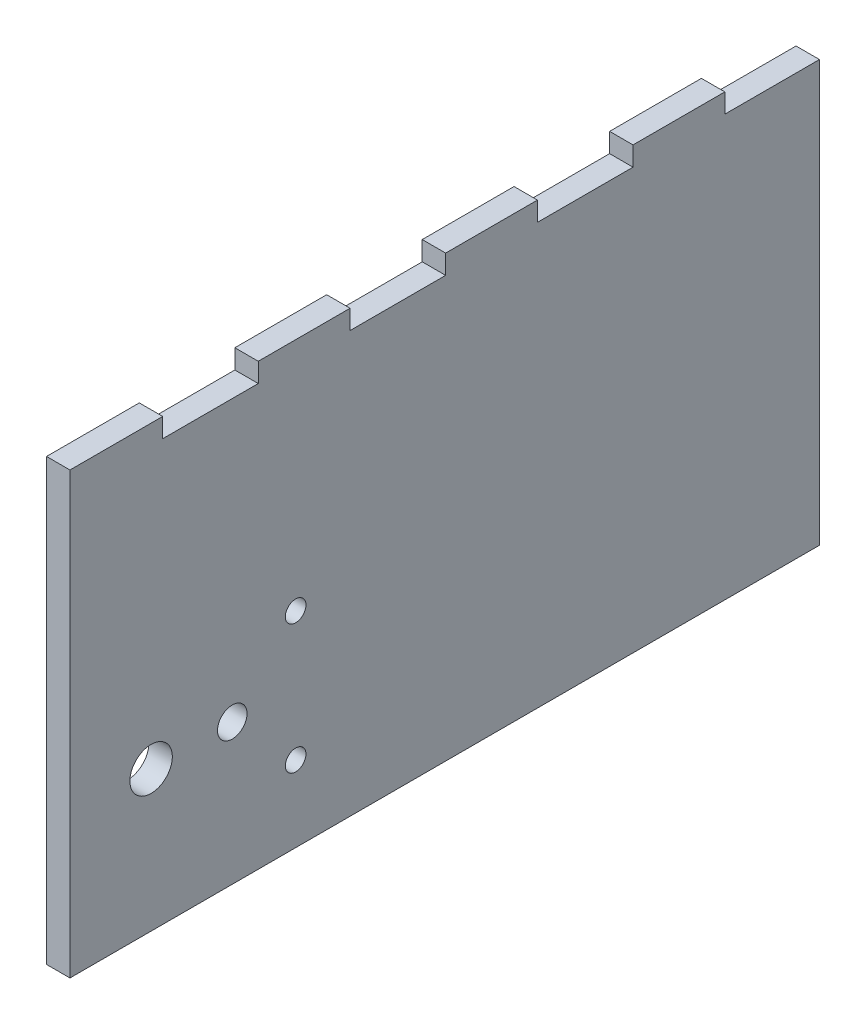
ISO-10303-21;
HEADER;
FILE_DESCRIPTION(('STEP AP214'),'2;1');
FILE_NAME('part.step','',(''),(''),'','','');
FILE_SCHEMA(('AUTOMOTIVE_DESIGN { 1 0 10303 214 1 1 1 1 }'));
ENDSEC;
DATA;
#1=APPLICATION_CONTEXT('core data for automotive mechanical design processes');
#2=APPLICATION_PROTOCOL_DEFINITION('international standard','automotive_design',2000,#1);
#3=PRODUCT_CONTEXT('',#1,'mechanical');
#4=PRODUCT('Part','Part','',(#3));
#5=PRODUCT_RELATED_PRODUCT_CATEGORY('part','',(#4));
#6=PRODUCT_DEFINITION_FORMATION('','',#4);
#7=PRODUCT_DEFINITION_CONTEXT('part definition',#1,'design');
#8=PRODUCT_DEFINITION('design','',#6,#7);
#9=PRODUCT_DEFINITION_SHAPE('','',#8);
#10=(LENGTH_UNIT() NAMED_UNIT(*) SI_UNIT(.MILLI.,.METRE.));
#11=(NAMED_UNIT(*) PLANE_ANGLE_UNIT() SI_UNIT($,.RADIAN.));
#12=(NAMED_UNIT(*) SI_UNIT($,.STERADIAN.) SOLID_ANGLE_UNIT());
#13=UNCERTAINTY_MEASURE_WITH_UNIT(LENGTH_MEASURE(1.E-05),#10,'distance_accuracy_value','');
#14=(GEOMETRIC_REPRESENTATION_CONTEXT(3) GLOBAL_UNCERTAINTY_ASSIGNED_CONTEXT((#13)) GLOBAL_UNIT_ASSIGNED_CONTEXT((#10,
#11,#12)) REPRESENTATION_CONTEXT('',''));
#15=CARTESIAN_POINT('',(0.,0.,0.));
#16=DIRECTION('',(0.,0.,1.));
#17=DIRECTION('',(1.,0.,0.));
#18=AXIS2_PLACEMENT_3D('',#15,#16,#17);
#19=CARTESIAN_POINT('',(3.175,0.,-101.6));
#20=DIRECTION('',(0.,1.,0.));
#21=DIRECTION('',(0.,0.,1.));
#22=AXIS2_PLACEMENT_3D('',#19,#20,#21);
#23=PLANE('',#22);
#24=DIRECTION('',(0.,0.,-1.));
#25=VECTOR('',#24,1.);
#26=CARTESIAN_POINT('',(0.,0.,-101.6));
#27=LINE('',#26,#25);
#28=CARTESIAN_POINT('',(0.,0.,0.));
#29=VERTEX_POINT('',#28);
#30=CARTESIAN_POINT('',(0.,0.,-101.6));
#31=VERTEX_POINT('',#30);
#32=EDGE_CURVE('E284',#29,#31,#27,.T.);
#33=ORIENTED_EDGE('',*,*,#32,.T.);
#34=DIRECTION('',(-1.,0.,0.));
#35=VECTOR('',#34,1.);
#36=CARTESIAN_POINT('',(3.175,0.,-101.6));
#37=LINE('',#36,#35);
#38=CARTESIAN_POINT('',(3.175,0.,-101.6));
#39=VERTEX_POINT('',#38);
#40=EDGE_CURVE('E11',#39,#31,#37,.T.);
#41=ORIENTED_EDGE('',*,*,#40,.F.);
#42=DIRECTION('',(0.,0.,-1.));
#43=VECTOR('',#42,1.);
#44=CARTESIAN_POINT('',(3.175,0.,-101.6));
#45=LINE('',#44,#43);
#46=CARTESIAN_POINT('',(3.175,0.,0.));
#47=VERTEX_POINT('',#46);
#48=EDGE_CURVE('E287',#47,#39,#45,.T.);
#49=ORIENTED_EDGE('',*,*,#48,.F.);
#50=DIRECTION('',(-1.,0.,0.));
#51=VECTOR('',#50,1.);
#52=CARTESIAN_POINT('',(3.175,0.,0.));
#53=LINE('',#52,#51);
#54=EDGE_CURVE('E304',#47,#29,#53,.T.);
#55=ORIENTED_EDGE('',*,*,#54,.T.);
#56=EDGE_LOOP('',(#33,#41,#49,#55));
#57=FACE_BOUND('',#56,.T.);
#58=ADVANCED_FACE('F33',(#57),#23,.F.);
#59=CARTESIAN_POINT('',(3.175,57.15,-101.6));
#60=DIRECTION('',(0.,0.,1.));
#61=DIRECTION('',(0.,-1.,0.));
#62=AXIS2_PLACEMENT_3D('',#59,#60,#61);
#63=PLANE('',#62);
#64=DIRECTION('',(0.,1.,0.));
#65=VECTOR('',#64,1.);
#66=CARTESIAN_POINT('',(0.,57.15,-101.6));
#67=LINE('',#66,#65);
#68=CARTESIAN_POINT('',(0.,57.023,-101.6));
#69=VERTEX_POINT('',#68);
#70=EDGE_CURVE('E307',#31,#69,#67,.T.);
#71=ORIENTED_EDGE('',*,*,#70,.T.);
#72=DIRECTION('',(1.,0.,0.));
#73=VECTOR('',#72,1.);
#74=CARTESIAN_POINT('',(0.,57.023,-101.6));
#75=LINE('',#74,#73);
#76=CARTESIAN_POINT('',(3.175,57.023,-101.6));
#77=VERTEX_POINT('',#76);
#78=EDGE_CURVE('E47',#69,#77,#75,.T.);
#79=ORIENTED_EDGE('',*,*,#78,.T.);
#80=DIRECTION('',(0.,1.,0.));
#81=VECTOR('',#80,1.);
#82=CARTESIAN_POINT('',(3.175,57.15,-101.6));
#83=LINE('',#82,#81);
#84=EDGE_CURVE('E290',#39,#77,#83,.T.);
#85=ORIENTED_EDGE('',*,*,#84,.F.);
#86=ORIENTED_EDGE('',*,*,#40,.T.);
#87=EDGE_LOOP('',(#71,#79,#85,#86));
#88=FACE_BOUND('',#87,.T.);
#89=ADVANCED_FACE('F384',(#88),#63,.F.);
#90=CARTESIAN_POINT('',(3.175,59.6392,-76.2));
#91=DIRECTION('',(0.,-1.,0.));
#92=DIRECTION('',(0.,0.,-1.));
#93=AXIS2_PLACEMENT_3D('',#90,#91,#92);
#94=PLANE('',#93);
#95=DIRECTION('',(0.,0.,1.));
#96=VECTOR('',#95,1.);
#97=CARTESIAN_POINT('',(3.175,59.6392,-76.2));
#98=LINE('',#97,#96);
#99=CARTESIAN_POINT('',(3.175,59.6392,-88.773));
#100=VERTEX_POINT('',#99);
#101=CARTESIAN_POINT('',(3.175,59.6392,-76.327));
#102=VERTEX_POINT('',#101);
#103=EDGE_CURVE('E294',#100,#102,#98,.T.);
#104=ORIENTED_EDGE('',*,*,#103,.F.);
#105=DIRECTION('',(1.,0.,0.));
#106=VECTOR('',#105,1.);
#107=CARTESIAN_POINT('',(0.,59.6392,-88.773));
#108=LINE('',#107,#106);
#109=CARTESIAN_POINT('',(0.,59.6392,-88.773));
#110=VERTEX_POINT('',#109);
#111=EDGE_CURVE('E180',#110,#100,#108,.T.);
#112=ORIENTED_EDGE('',*,*,#111,.F.);
#113=DIRECTION('',(0.,0.,1.));
#114=VECTOR('',#113,1.);
#115=CARTESIAN_POINT('',(0.,59.6392,-76.2));
#116=LINE('',#115,#114);
#117=CARTESIAN_POINT('',(0.,59.6392,-76.327));
#118=VERTEX_POINT('',#117);
#119=EDGE_CURVE('E55',#110,#118,#116,.T.);
#120=ORIENTED_EDGE('',*,*,#119,.T.);
#121=DIRECTION('',(1.,0.,0.));
#122=VECTOR('',#121,1.);
#123=CARTESIAN_POINT('',(0.,59.6392,-76.327));
#124=LINE('',#123,#122);
#125=EDGE_CURVE('E206',#118,#102,#124,.T.);
#126=ORIENTED_EDGE('',*,*,#125,.T.);
#127=EDGE_LOOP('',(#104,#112,#120,#126));
#128=FACE_BOUND('',#127,.T.);
#129=ADVANCED_FACE('F382',(#128),#94,.F.);
#130=CARTESIAN_POINT('',(3.175,59.6392,-50.8));
#131=DIRECTION('',(0.,-1.,0.));
#132=DIRECTION('',(0.,0.,-1.));
#133=AXIS2_PLACEMENT_3D('',#130,#131,#132);
#134=PLANE('',#133);
#135=DIRECTION('',(0.,0.,1.));
#136=VECTOR('',#135,1.);
#137=CARTESIAN_POINT('',(3.175,59.6392,-50.8));
#138=LINE('',#137,#136);
#139=CARTESIAN_POINT('',(3.175,59.6392,-63.373));
#140=VERTEX_POINT('',#139);
#141=CARTESIAN_POINT('',(3.175,59.6392,-50.927));
#142=VERTEX_POINT('',#141);
#143=EDGE_CURVE('E296',#140,#142,#138,.T.);
#144=ORIENTED_EDGE('',*,*,#143,.F.);
#145=DIRECTION('',(1.,0.,0.));
#146=VECTOR('',#145,1.);
#147=CARTESIAN_POINT('',(0.,59.6392,-63.373));
#148=LINE('',#147,#146);
#149=CARTESIAN_POINT('',(0.,59.6392,-63.373));
#150=VERTEX_POINT('',#149);
#151=EDGE_CURVE('E204',#150,#140,#148,.T.);
#152=ORIENTED_EDGE('',*,*,#151,.F.);
#153=DIRECTION('',(0.,0.,1.));
#154=VECTOR('',#153,1.);
#155=CARTESIAN_POINT('',(0.,59.6392,-50.8));
#156=LINE('',#155,#154);
#157=CARTESIAN_POINT('',(0.,59.6392,-50.927));
#158=VERTEX_POINT('',#157);
#159=EDGE_CURVE('E310',#150,#158,#156,.T.);
#160=ORIENTED_EDGE('',*,*,#159,.T.);
#161=DIRECTION('',(1.,0.,0.));
#162=VECTOR('',#161,1.);
#163=CARTESIAN_POINT('',(0.,59.6392,-50.927));
#164=LINE('',#163,#162);
#165=EDGE_CURVE('E232',#158,#142,#164,.T.);
#166=ORIENTED_EDGE('',*,*,#165,.T.);
#167=EDGE_LOOP('',(#144,#152,#160,#166));
#168=FACE_BOUND('',#167,.T.);
#169=ADVANCED_FACE('F369',(#168),#134,.F.);
#170=CARTESIAN_POINT('',(3.175,59.6392,-25.4));
#171=DIRECTION('',(0.,-1.,0.));
#172=DIRECTION('',(0.,0.,-1.));
#173=AXIS2_PLACEMENT_3D('',#170,#171,#172);
#174=PLANE('',#173);
#175=DIRECTION('',(0.,0.,1.));
#176=VECTOR('',#175,1.);
#177=CARTESIAN_POINT('',(3.175,59.6392,-25.4));
#178=LINE('',#177,#176);
#179=CARTESIAN_POINT('',(3.175,59.6392,-37.973));
#180=VERTEX_POINT('',#179);
#181=CARTESIAN_POINT('',(3.175,59.6392,-25.527));
#182=VERTEX_POINT('',#181);
#183=EDGE_CURVE('E298',#180,#182,#178,.T.);
#184=ORIENTED_EDGE('',*,*,#183,.F.);
#185=DIRECTION('',(1.,0.,0.));
#186=VECTOR('',#185,1.);
#187=CARTESIAN_POINT('',(0.,59.6392,-37.973));
#188=LINE('',#187,#186);
#189=CARTESIAN_POINT('',(0.,59.6392,-37.973));
#190=VERTEX_POINT('',#189);
#191=EDGE_CURVE('E230',#190,#180,#188,.T.);
#192=ORIENTED_EDGE('',*,*,#191,.F.);
#193=DIRECTION('',(0.,0.,1.));
#194=VECTOR('',#193,1.);
#195=CARTESIAN_POINT('',(0.,59.6392,-25.4));
#196=LINE('',#195,#194);
#197=CARTESIAN_POINT('',(0.,59.6392,-25.527));
#198=VERTEX_POINT('',#197);
#199=EDGE_CURVE('E312',#190,#198,#196,.T.);
#200=ORIENTED_EDGE('',*,*,#199,.T.);
#201=DIRECTION('',(1.,0.,0.));
#202=VECTOR('',#201,1.);
#203=CARTESIAN_POINT('',(0.,59.6392,-25.527));
#204=LINE('',#203,#202);
#205=EDGE_CURVE('E259',#198,#182,#204,.T.);
#206=ORIENTED_EDGE('',*,*,#205,.T.);
#207=EDGE_LOOP('',(#184,#192,#200,#206));
#208=FACE_BOUND('',#207,.T.);
#209=ADVANCED_FACE('F351',(#208),#174,.F.);
#210=CARTESIAN_POINT('',(3.175,59.6392,0.));
#211=DIRECTION('',(0.,-1.,0.));
#212=DIRECTION('',(0.,0.,-1.));
#213=AXIS2_PLACEMENT_3D('',#210,#211,#212);
#214=PLANE('',#213);
#215=DIRECTION('',(0.,0.,1.));
#216=VECTOR('',#215,1.);
#217=CARTESIAN_POINT('',(3.175,59.6392,0.));
#218=LINE('',#217,#216);
#219=CARTESIAN_POINT('',(3.175,59.6392,-12.573));
#220=VERTEX_POINT('',#219);
#221=CARTESIAN_POINT('',(3.175,59.6392,0.));
#222=VERTEX_POINT('',#221);
#223=EDGE_CURVE('E300',#220,#222,#218,.T.);
#224=ORIENTED_EDGE('',*,*,#223,.F.);
#225=DIRECTION('',(1.,0.,0.));
#226=VECTOR('',#225,1.);
#227=CARTESIAN_POINT('',(0.,59.6392,-12.573));
#228=LINE('',#227,#226);
#229=CARTESIAN_POINT('',(0.,59.6392,-12.573));
#230=VERTEX_POINT('',#229);
#231=EDGE_CURVE('E257',#230,#220,#228,.T.);
#232=ORIENTED_EDGE('',*,*,#231,.F.);
#233=DIRECTION('',(0.,0.,1.));
#234=VECTOR('',#233,1.);
#235=CARTESIAN_POINT('',(0.,59.6392,0.));
#236=LINE('',#235,#234);
#237=CARTESIAN_POINT('',(0.,59.6392,0.));
#238=VERTEX_POINT('',#237);
#239=EDGE_CURVE('E314',#230,#238,#236,.T.);
#240=ORIENTED_EDGE('',*,*,#239,.T.);
#241=DIRECTION('',(-1.,0.,0.));
#242=VECTOR('',#241,1.);
#243=CARTESIAN_POINT('',(3.175,59.6392,0.));
#244=LINE('',#243,#242);
#245=EDGE_CURVE('E40',#222,#238,#244,.T.);
#246=ORIENTED_EDGE('',*,*,#245,.F.);
#247=EDGE_LOOP('',(#224,#232,#240,#246));
#248=FACE_BOUND('',#247,.T.);
#249=ADVANCED_FACE('F337',(#248),#214,.F.);
#250=CARTESIAN_POINT('',(3.175,0.,0.));
#251=DIRECTION('',(0.,0.,-1.));
#252=DIRECTION('',(-1.,0.,0.));
#253=AXIS2_PLACEMENT_3D('',#250,#251,#252);
#254=PLANE('',#253);
#255=DIRECTION('',(0.,-1.,0.));
#256=VECTOR('',#255,1.);
#257=CARTESIAN_POINT('',(0.,0.,0.));
#258=LINE('',#257,#256);
#259=EDGE_CURVE('E291',#238,#29,#258,.T.);
#260=ORIENTED_EDGE('',*,*,#259,.T.);
#261=ORIENTED_EDGE('',*,*,#54,.F.);
#262=DIRECTION('',(0.,-1.,0.));
#263=VECTOR('',#262,1.);
#264=CARTESIAN_POINT('',(3.175,0.,0.));
#265=LINE('',#264,#263);
#266=EDGE_CURVE('E302',#222,#47,#265,.T.);
#267=ORIENTED_EDGE('',*,*,#266,.F.);
#268=ORIENTED_EDGE('',*,*,#245,.T.);
#269=EDGE_LOOP('',(#260,#261,#267,#268));
#270=FACE_BOUND('',#269,.T.);
#271=ADVANCED_FACE('F323',(#270),#254,.F.);
#272=CARTESIAN_POINT('',(3.175,0.,0.));
#273=DIRECTION('',(-1.,0.,0.));
#274=DIRECTION('',(0.,0.,1.));
#275=AXIS2_PLACEMENT_3D('',#272,#273,#274);
#276=PLANE('',#275);
#277=CARTESIAN_POINT('',(3.175,19.05,-11.));
#278=DIRECTION('',(1.,0.,0.));
#279=DIRECTION('',(0.,0.,1.));
#280=AXIS2_PLACEMENT_3D('',#277,#278,#279);
#281=CIRCLE('',#280,2.87699996099999);
#282=CARTESIAN_POINT('',(3.175,19.05,-8.12300003899999));
#283=VERTEX_POINT('',#282);
#284=EDGE_CURVE('E263',#283,#283,#281,.T.);
#285=ORIENTED_EDGE('',*,*,#284,.F.);
#286=EDGE_LOOP('',(#285));
#287=FACE_BOUND('',#286,.T.);
#288=CARTESIAN_POINT('',(3.175,19.05,-22.0000034));
#289=DIRECTION('',(1.,0.,0.));
#290=DIRECTION('',(0.,0.,1.));
#291=AXIS2_PLACEMENT_3D('',#288,#289,#290);
#292=CIRCLE('',#291,1.99999999999998);
#293=CARTESIAN_POINT('',(3.175,19.05,-20.0000034));
#294=VERTEX_POINT('',#293);
#295=EDGE_CURVE('E269',#294,#294,#292,.T.);
#296=ORIENTED_EDGE('',*,*,#295,.F.);
#297=EDGE_LOOP('',(#296));
#298=FACE_BOUND('',#297,.T.);
#299=CARTESIAN_POINT('',(3.175,27.8,-30.59102));
#300=DIRECTION('',(1.,0.,0.));
#301=DIRECTION('',(0.,0.,1.));
#302=AXIS2_PLACEMENT_3D('',#299,#300,#301);
#303=CIRCLE('',#302,1.39999999999999);
#304=CARTESIAN_POINT('',(3.175,27.8,-29.19102));
#305=VERTEX_POINT('',#304);
#306=EDGE_CURVE('E275',#305,#305,#303,.T.);
#307=ORIENTED_EDGE('',*,*,#306,.F.);
#308=EDGE_LOOP('',(#307));
#309=FACE_BOUND('',#308,.T.);
#310=CARTESIAN_POINT('',(3.175,10.3,-30.59102));
#311=DIRECTION('',(1.,0.,0.));
#312=DIRECTION('',(0.,0.,1.));
#313=AXIS2_PLACEMENT_3D('',#310,#311,#312);
#314=CIRCLE('',#313,1.39999999999999);
#315=CARTESIAN_POINT('',(3.175,10.3,-29.19102));
#316=VERTEX_POINT('',#315);
#317=EDGE_CURVE('E281',#316,#316,#314,.T.);
#318=ORIENTED_EDGE('',*,*,#317,.F.);
#319=EDGE_LOOP('',(#318));
#320=FACE_BOUND('',#319,.T.);
#321=DIRECTION('',(0.,0.,-1.));
#322=VECTOR('',#321,1.);
#323=CARTESIAN_POINT('',(3.175,57.0230000000001,0.));
#324=LINE('',#323,#322);
#325=CARTESIAN_POINT('',(3.175,57.023,-88.773));
#326=VERTEX_POINT('',#325);
#327=EDGE_CURVE('E175',#326,#77,#324,.T.);
#328=ORIENTED_EDGE('',*,*,#327,.F.);
#329=DIRECTION('',(0.,-1.,0.));
#330=VECTOR('',#329,1.);
#331=CARTESIAN_POINT('',(3.175,0.,-88.773));
#332=LINE('',#331,#330);
#333=EDGE_CURVE('E164',#100,#326,#332,.T.);
#334=ORIENTED_EDGE('',*,*,#333,.F.);
#335=ORIENTED_EDGE('',*,*,#103,.T.);
#336=DIRECTION('',(0.,1.,0.));
#337=VECTOR('',#336,1.);
#338=CARTESIAN_POINT('',(3.175,0.,-76.327));
#339=LINE('',#338,#337);
#340=CARTESIAN_POINT('',(3.175,57.023,-76.327));
#341=VERTEX_POINT('',#340);
#342=EDGE_CURVE('E196',#341,#102,#339,.T.);
#343=ORIENTED_EDGE('',*,*,#342,.F.);
#344=DIRECTION('',(0.,0.,-1.));
#345=VECTOR('',#344,1.);
#346=CARTESIAN_POINT('',(3.175,57.023,0.));
#347=LINE('',#346,#345);
#348=CARTESIAN_POINT('',(3.175,57.023,-63.373));
#349=VERTEX_POINT('',#348);
#350=EDGE_CURVE('E182',#349,#341,#347,.T.);
#351=ORIENTED_EDGE('',*,*,#350,.F.);
#352=DIRECTION('',(0.,-1.,0.));
#353=VECTOR('',#352,1.);
#354=CARTESIAN_POINT('',(3.175,0.,-63.373));
#355=LINE('',#354,#353);
#356=EDGE_CURVE('E188',#140,#349,#355,.T.);
#357=ORIENTED_EDGE('',*,*,#356,.F.);
#358=ORIENTED_EDGE('',*,*,#143,.T.);
#359=DIRECTION('',(0.,1.,0.));
#360=VECTOR('',#359,1.);
#361=CARTESIAN_POINT('',(3.175,0.,-50.927));
#362=LINE('',#361,#360);
#363=CARTESIAN_POINT('',(3.175,57.023,-50.927));
#364=VERTEX_POINT('',#363);
#365=EDGE_CURVE('E222',#364,#142,#362,.T.);
#366=ORIENTED_EDGE('',*,*,#365,.F.);
#367=DIRECTION('',(0.,0.,-1.));
#368=VECTOR('',#367,1.);
#369=CARTESIAN_POINT('',(3.175,57.023,0.));
#370=LINE('',#369,#368);
#371=CARTESIAN_POINT('',(3.175,57.023,-37.973));
#372=VERTEX_POINT('',#371);
#373=EDGE_CURVE('E203',#372,#364,#370,.T.);
#374=ORIENTED_EDGE('',*,*,#373,.F.);
#375=DIRECTION('',(0.,-1.,0.));
#376=VECTOR('',#375,1.);
#377=CARTESIAN_POINT('',(3.175,0.,-37.973));
#378=LINE('',#377,#376);
#379=EDGE_CURVE('E213',#180,#372,#378,.T.);
#380=ORIENTED_EDGE('',*,*,#379,.F.);
#381=ORIENTED_EDGE('',*,*,#183,.T.);
#382=DIRECTION('',(0.,1.,0.));
#383=VECTOR('',#382,1.);
#384=CARTESIAN_POINT('',(3.175,0.,-25.527));
#385=LINE('',#384,#383);
#386=CARTESIAN_POINT('',(3.175,57.023,-25.527));
#387=VERTEX_POINT('',#386);
#388=EDGE_CURVE('E249',#387,#182,#385,.T.);
#389=ORIENTED_EDGE('',*,*,#388,.F.);
#390=DIRECTION('',(0.,0.,-1.));
#391=VECTOR('',#390,1.);
#392=CARTESIAN_POINT('',(3.175,57.023,0.));
#393=LINE('',#392,#391);
#394=CARTESIAN_POINT('',(3.175,57.023,-12.573));
#395=VERTEX_POINT('',#394);
#396=EDGE_CURVE('E229',#395,#387,#393,.T.);
#397=ORIENTED_EDGE('',*,*,#396,.F.);
#398=DIRECTION('',(0.,-1.,0.));
#399=VECTOR('',#398,1.);
#400=CARTESIAN_POINT('',(3.175,0.,-12.573));
#401=LINE('',#400,#399);
#402=EDGE_CURVE('E240',#220,#395,#401,.T.);
#403=ORIENTED_EDGE('',*,*,#402,.F.);
#404=ORIENTED_EDGE('',*,*,#223,.T.);
#405=ORIENTED_EDGE('',*,*,#266,.T.);
#406=ORIENTED_EDGE('',*,*,#48,.T.);
#407=ORIENTED_EDGE('',*,*,#84,.T.);
#408=EDGE_LOOP('',(#328,#334,#335,#343,#351,#357,#358,#366,#374,#380,#381,#389,#397,#403,#404,
#405,#406,#407));
#409=FACE_BOUND('',#408,.T.);
#410=ADVANCED_FACE('F333',(#287,#298,#309,#320,#409),#276,.F.);
#411=CARTESIAN_POINT('',(0.,0.,0.));
#412=DIRECTION('',(-1.,0.,0.));
#413=DIRECTION('',(0.,0.,1.));
#414=AXIS2_PLACEMENT_3D('',#411,#412,#413);
#415=PLANE('',#414);
#416=DIRECTION('',(0.,-1.,0.));
#417=VECTOR('',#416,1.);
#418=CARTESIAN_POINT('',(0.,0.,-88.773));
#419=LINE('',#418,#417);
#420=CARTESIAN_POINT('',(0.,57.023,-88.773));
#421=VERTEX_POINT('',#420);
#422=EDGE_CURVE('E162',#110,#421,#419,.T.);
#423=ORIENTED_EDGE('',*,*,#422,.T.);
#424=DIRECTION('',(0.,0.,-1.));
#425=VECTOR('',#424,1.);
#426=CARTESIAN_POINT('',(0.,57.0230000000001,0.));
#427=LINE('',#426,#425);
#428=EDGE_CURVE('E166',#421,#69,#427,.T.);
#429=ORIENTED_EDGE('',*,*,#428,.T.);
#430=ORIENTED_EDGE('',*,*,#70,.F.);
#431=ORIENTED_EDGE('',*,*,#32,.F.);
#432=ORIENTED_EDGE('',*,*,#259,.F.);
#433=ORIENTED_EDGE('',*,*,#239,.F.);
#434=DIRECTION('',(0.,-1.,0.));
#435=VECTOR('',#434,1.);
#436=CARTESIAN_POINT('',(0.,0.,-12.573));
#437=LINE('',#436,#435);
#438=CARTESIAN_POINT('',(0.,57.023,-12.573));
#439=VERTEX_POINT('',#438);
#440=EDGE_CURVE('E243',#230,#439,#437,.T.);
#441=ORIENTED_EDGE('',*,*,#440,.T.);
#442=DIRECTION('',(0.,0.,-1.));
#443=VECTOR('',#442,1.);
#444=CARTESIAN_POINT('',(0.,57.023,0.));
#445=LINE('',#444,#443);
#446=CARTESIAN_POINT('',(0.,57.023,-25.527));
#447=VERTEX_POINT('',#446);
#448=EDGE_CURVE('E236',#439,#447,#445,.T.);
#449=ORIENTED_EDGE('',*,*,#448,.T.);
#450=DIRECTION('',(0.,1.,0.));
#451=VECTOR('',#450,1.);
#452=CARTESIAN_POINT('',(0.,0.,-25.527));
#453=LINE('',#452,#451);
#454=EDGE_CURVE('E239',#447,#198,#453,.T.);
#455=ORIENTED_EDGE('',*,*,#454,.T.);
#456=ORIENTED_EDGE('',*,*,#199,.F.);
#457=DIRECTION('',(0.,-1.,0.));
#458=VECTOR('',#457,1.);
#459=CARTESIAN_POINT('',(0.,0.,-37.973));
#460=LINE('',#459,#458);
#461=CARTESIAN_POINT('',(0.,57.023,-37.973));
#462=VERTEX_POINT('',#461);
#463=EDGE_CURVE('E216',#190,#462,#460,.T.);
#464=ORIENTED_EDGE('',*,*,#463,.T.);
#465=DIRECTION('',(0.,0.,-1.));
#466=VECTOR('',#465,1.);
#467=CARTESIAN_POINT('',(0.,57.023,0.));
#468=LINE('',#467,#466);
#469=CARTESIAN_POINT('',(0.,57.023,-50.927));
#470=VERTEX_POINT('',#469);
#471=EDGE_CURVE('E209',#462,#470,#468,.T.);
#472=ORIENTED_EDGE('',*,*,#471,.T.);
#473=DIRECTION('',(0.,1.,0.));
#474=VECTOR('',#473,1.);
#475=CARTESIAN_POINT('',(0.,0.,-50.927));
#476=LINE('',#475,#474);
#477=EDGE_CURVE('E212',#470,#158,#476,.T.);
#478=ORIENTED_EDGE('',*,*,#477,.T.);
#479=ORIENTED_EDGE('',*,*,#159,.F.);
#480=DIRECTION('',(0.,-1.,0.));
#481=VECTOR('',#480,1.);
#482=CARTESIAN_POINT('',(0.,0.,-63.373));
#483=LINE('',#482,#481);
#484=CARTESIAN_POINT('',(0.,57.023,-63.373));
#485=VERTEX_POINT('',#484);
#486=EDGE_CURVE('E190',#150,#485,#483,.T.);
#487=ORIENTED_EDGE('',*,*,#486,.T.);
#488=DIRECTION('',(0.,0.,-1.));
#489=VECTOR('',#488,1.);
#490=CARTESIAN_POINT('',(0.,57.023,0.));
#491=LINE('',#490,#489);
#492=CARTESIAN_POINT('',(0.,57.023,-76.327));
#493=VERTEX_POINT('',#492);
#494=EDGE_CURVE('E184',#485,#493,#491,.T.);
#495=ORIENTED_EDGE('',*,*,#494,.T.);
#496=DIRECTION('',(0.,1.,0.));
#497=VECTOR('',#496,1.);
#498=CARTESIAN_POINT('',(0.,0.,-76.327));
#499=LINE('',#498,#497);
#500=EDGE_CURVE('E187',#493,#118,#499,.T.);
#501=ORIENTED_EDGE('',*,*,#500,.T.);
#502=ORIENTED_EDGE('',*,*,#119,.F.);
#503=EDGE_LOOP('',(#423,#429,#430,#431,#432,#433,#441,#449,#455,#456,#464,#472,#478,#479,#487,
#495,#501,#502));
#504=FACE_BOUND('',#503,.T.);
#505=CARTESIAN_POINT('',(0.,19.05,-11.));
#506=DIRECTION('',(-1.,0.,0.));
#507=DIRECTION('',(0.,0.,1.));
#508=AXIS2_PLACEMENT_3D('',#505,#506,#507);
#509=CIRCLE('',#508,2.87699996099999);
#510=CARTESIAN_POINT('',(0.,19.05,-8.12300003899999));
#511=VERTEX_POINT('',#510);
#512=EDGE_CURVE('E256',#511,#511,#509,.F.);
#513=ORIENTED_EDGE('',*,*,#512,.T.);
#514=EDGE_LOOP('',(#513));
#515=FACE_BOUND('',#514,.T.);
#516=CARTESIAN_POINT('',(0.,19.05,-22.0000034));
#517=DIRECTION('',(-1.,0.,0.));
#518=DIRECTION('',(0.,0.,1.));
#519=AXIS2_PLACEMENT_3D('',#516,#517,#518);
#520=CIRCLE('',#519,1.99999999999998);
#521=CARTESIAN_POINT('',(0.,19.05,-20.0000034));
#522=VERTEX_POINT('',#521);
#523=EDGE_CURVE('E266',#522,#522,#520,.F.);
#524=ORIENTED_EDGE('',*,*,#523,.T.);
#525=EDGE_LOOP('',(#524));
#526=FACE_BOUND('',#525,.T.);
#527=CARTESIAN_POINT('',(0.,27.8,-30.59102));
#528=DIRECTION('',(-1.,0.,0.));
#529=DIRECTION('',(0.,0.,1.));
#530=AXIS2_PLACEMENT_3D('',#527,#528,#529);
#531=CIRCLE('',#530,1.39999999999999);
#532=CARTESIAN_POINT('',(0.,27.8,-29.19102));
#533=VERTEX_POINT('',#532);
#534=EDGE_CURVE('E272',#533,#533,#531,.F.);
#535=ORIENTED_EDGE('',*,*,#534,.T.);
#536=EDGE_LOOP('',(#535));
#537=FACE_BOUND('',#536,.T.);
#538=CARTESIAN_POINT('',(0.,10.3,-30.59102));
#539=DIRECTION('',(-1.,0.,0.));
#540=DIRECTION('',(0.,0.,1.));
#541=AXIS2_PLACEMENT_3D('',#538,#539,#540);
#542=CIRCLE('',#541,1.39999999999999);
#543=CARTESIAN_POINT('',(0.,10.3,-29.19102));
#544=VERTEX_POINT('',#543);
#545=EDGE_CURVE('E278',#544,#544,#542,.F.);
#546=ORIENTED_EDGE('',*,*,#545,.T.);
#547=EDGE_LOOP('',(#546));
#548=FACE_BOUND('',#547,.T.);
#549=ADVANCED_FACE('F172',(#504,#515,#526,#537,#548),#415,.T.);
#550=CARTESIAN_POINT('',(-0.00100000000000013,10.3,-30.59102));
#551=DIRECTION('',(1.,0.,0.));
#552=DIRECTION('',(0.,0.,-1.));
#553=AXIS2_PLACEMENT_3D('',#550,#551,#552);
#554=CYLINDRICAL_SURFACE('',#553,1.39999999999999);
#555=ORIENTED_EDGE('',*,*,#545,.F.);
#556=EDGE_LOOP('',(#555));
#557=FACE_BOUND('',#556,.T.);
#558=ORIENTED_EDGE('',*,*,#317,.T.);
#559=EDGE_LOOP('',(#558));
#560=FACE_BOUND('',#559,.T.);
#561=ADVANCED_FACE('F402',(#557,#560),#554,.F.);
#562=CARTESIAN_POINT('',(-0.00100000000000013,27.8,-30.59102));
#563=DIRECTION('',(1.,0.,0.));
#564=DIRECTION('',(0.,0.,-1.));
#565=AXIS2_PLACEMENT_3D('',#562,#563,#564);
#566=CYLINDRICAL_SURFACE('',#565,1.39999999999999);
#567=ORIENTED_EDGE('',*,*,#534,.F.);
#568=EDGE_LOOP('',(#567));
#569=FACE_BOUND('',#568,.T.);
#570=ORIENTED_EDGE('',*,*,#306,.T.);
#571=EDGE_LOOP('',(#570));
#572=FACE_BOUND('',#571,.T.);
#573=ADVANCED_FACE('F408',(#569,#572),#566,.F.);
#574=CARTESIAN_POINT('',(-0.00100000000000013,19.05,-22.0000034));
#575=DIRECTION('',(1.,0.,0.));
#576=DIRECTION('',(0.,0.,-1.));
#577=AXIS2_PLACEMENT_3D('',#574,#575,#576);
#578=CYLINDRICAL_SURFACE('',#577,1.99999999999998);
#579=ORIENTED_EDGE('',*,*,#523,.F.);
#580=EDGE_LOOP('',(#579));
#581=FACE_BOUND('',#580,.T.);
#582=ORIENTED_EDGE('',*,*,#295,.T.);
#583=EDGE_LOOP('',(#582));
#584=FACE_BOUND('',#583,.T.);
#585=ADVANCED_FACE('F412',(#581,#584),#578,.F.);
#586=CARTESIAN_POINT('',(-0.00100000000000013,19.05,-11.));
#587=DIRECTION('',(1.,0.,0.));
#588=DIRECTION('',(0.,0.,-1.));
#589=AXIS2_PLACEMENT_3D('',#586,#587,#588);
#590=CYLINDRICAL_SURFACE('',#589,2.87699996099999);
#591=ORIENTED_EDGE('',*,*,#512,.F.);
#592=EDGE_LOOP('',(#591));
#593=FACE_BOUND('',#592,.T.);
#594=ORIENTED_EDGE('',*,*,#284,.T.);
#595=EDGE_LOOP('',(#594));
#596=FACE_BOUND('',#595,.T.);
#597=ADVANCED_FACE('F416',(#593,#596),#590,.F.);
#598=CARTESIAN_POINT('',(0.,57.023,0.));
#599=DIRECTION('',(0.,-1.,0.));
#600=DIRECTION('',(0.,0.,-1.));
#601=AXIS2_PLACEMENT_3D('',#598,#599,#600);
#602=PLANE('',#601);
#603=ORIENTED_EDGE('',*,*,#396,.T.);
#604=DIRECTION('',(1.,0.,0.));
#605=VECTOR('',#604,1.);
#606=CARTESIAN_POINT('',(0.,57.023,-25.527));
#607=LINE('',#606,#605);
#608=EDGE_CURVE('E246',#447,#387,#607,.T.);
#609=ORIENTED_EDGE('',*,*,#608,.F.);
#610=ORIENTED_EDGE('',*,*,#448,.F.);
#611=DIRECTION('',(1.,0.,0.));
#612=VECTOR('',#611,1.);
#613=CARTESIAN_POINT('',(0.,57.023,-12.573));
#614=LINE('',#613,#612);
#615=EDGE_CURVE('E254',#439,#395,#614,.T.);
#616=ORIENTED_EDGE('',*,*,#615,.T.);
#617=EDGE_LOOP('',(#603,#609,#610,#616));
#618=FACE_BOUND('',#617,.T.);
#619=ADVANCED_FACE('F344',(#618),#602,.F.);
#620=CARTESIAN_POINT('',(0.,0.,-12.573));
#621=DIRECTION('',(0.,0.,1.));
#622=DIRECTION('',(1.,0.,0.));
#623=AXIS2_PLACEMENT_3D('',#620,#621,#622);
#624=PLANE('',#623);
#625=ORIENTED_EDGE('',*,*,#402,.T.);
#626=ORIENTED_EDGE('',*,*,#615,.F.);
#627=ORIENTED_EDGE('',*,*,#440,.F.);
#628=ORIENTED_EDGE('',*,*,#231,.T.);
#629=EDGE_LOOP('',(#625,#626,#627,#628));
#630=FACE_BOUND('',#629,.T.);
#631=ADVANCED_FACE('F339',(#630),#624,.F.);
#632=CARTESIAN_POINT('',(0.,0.,-25.527));
#633=DIRECTION('',(0.,0.,-1.));
#634=DIRECTION('',(-1.,0.,0.));
#635=AXIS2_PLACEMENT_3D('',#632,#633,#634);
#636=PLANE('',#635);
#637=ORIENTED_EDGE('',*,*,#388,.T.);
#638=ORIENTED_EDGE('',*,*,#205,.F.);
#639=ORIENTED_EDGE('',*,*,#454,.F.);
#640=ORIENTED_EDGE('',*,*,#608,.T.);
#641=EDGE_LOOP('',(#637,#638,#639,#640));
#642=FACE_BOUND('',#641,.T.);
#643=ADVANCED_FACE('F348',(#642),#636,.F.);
#644=CARTESIAN_POINT('',(0.,57.023,0.));
#645=DIRECTION('',(0.,-1.,0.));
#646=DIRECTION('',(0.,0.,-1.));
#647=AXIS2_PLACEMENT_3D('',#644,#645,#646);
#648=PLANE('',#647);
#649=ORIENTED_EDGE('',*,*,#373,.T.);
#650=DIRECTION('',(1.,0.,0.));
#651=VECTOR('',#650,1.);
#652=CARTESIAN_POINT('',(0.,57.023,-50.927));
#653=LINE('',#652,#651);
#654=EDGE_CURVE('E219',#470,#364,#653,.T.);
#655=ORIENTED_EDGE('',*,*,#654,.F.);
#656=ORIENTED_EDGE('',*,*,#471,.F.);
#657=DIRECTION('',(1.,0.,0.));
#658=VECTOR('',#657,1.);
#659=CARTESIAN_POINT('',(0.,57.023,-37.973));
#660=LINE('',#659,#658);
#661=EDGE_CURVE('E227',#462,#372,#660,.T.);
#662=ORIENTED_EDGE('',*,*,#661,.T.);
#663=EDGE_LOOP('',(#649,#655,#656,#662));
#664=FACE_BOUND('',#663,.T.);
#665=ADVANCED_FACE('F359',(#664),#648,.F.);
#666=CARTESIAN_POINT('',(0.,0.,-37.973));
#667=DIRECTION('',(0.,0.,1.));
#668=DIRECTION('',(1.,0.,0.));
#669=AXIS2_PLACEMENT_3D('',#666,#667,#668);
#670=PLANE('',#669);
#671=ORIENTED_EDGE('',*,*,#379,.T.);
#672=ORIENTED_EDGE('',*,*,#661,.F.);
#673=ORIENTED_EDGE('',*,*,#463,.F.);
#674=ORIENTED_EDGE('',*,*,#191,.T.);
#675=EDGE_LOOP('',(#671,#672,#673,#674));
#676=FACE_BOUND('',#675,.T.);
#677=ADVANCED_FACE('F355',(#676),#670,.F.);
#678=CARTESIAN_POINT('',(0.,0.,-50.927));
#679=DIRECTION('',(0.,0.,-1.));
#680=DIRECTION('',(-1.,0.,0.));
#681=AXIS2_PLACEMENT_3D('',#678,#679,#680);
#682=PLANE('',#681);
#683=ORIENTED_EDGE('',*,*,#365,.T.);
#684=ORIENTED_EDGE('',*,*,#165,.F.);
#685=ORIENTED_EDGE('',*,*,#477,.F.);
#686=ORIENTED_EDGE('',*,*,#654,.T.);
#687=EDGE_LOOP('',(#683,#684,#685,#686));
#688=FACE_BOUND('',#687,.T.);
#689=ADVANCED_FACE('F364',(#688),#682,.F.);
#690=CARTESIAN_POINT('',(0.,57.023,0.));
#691=DIRECTION('',(0.,-1.,0.));
#692=DIRECTION('',(0.,0.,-1.));
#693=AXIS2_PLACEMENT_3D('',#690,#691,#692);
#694=PLANE('',#693);
#695=ORIENTED_EDGE('',*,*,#350,.T.);
#696=DIRECTION('',(1.,0.,0.));
#697=VECTOR('',#696,1.);
#698=CARTESIAN_POINT('',(0.,57.023,-76.327));
#699=LINE('',#698,#697);
#700=EDGE_CURVE('E193',#493,#341,#699,.T.);
#701=ORIENTED_EDGE('',*,*,#700,.F.);
#702=ORIENTED_EDGE('',*,*,#494,.F.);
#703=DIRECTION('',(1.,0.,0.));
#704=VECTOR('',#703,1.);
#705=CARTESIAN_POINT('',(0.,57.023,-63.373));
#706=LINE('',#705,#704);
#707=EDGE_CURVE('E201',#485,#349,#706,.T.);
#708=ORIENTED_EDGE('',*,*,#707,.T.);
#709=EDGE_LOOP('',(#695,#701,#702,#708));
#710=FACE_BOUND('',#709,.T.);
#711=ADVANCED_FACE('F376',(#710),#694,.F.);
#712=CARTESIAN_POINT('',(0.,0.,-63.373));
#713=DIRECTION('',(0.,0.,1.));
#714=DIRECTION('',(1.,0.,0.));
#715=AXIS2_PLACEMENT_3D('',#712,#713,#714);
#716=PLANE('',#715);
#717=ORIENTED_EDGE('',*,*,#356,.T.);
#718=ORIENTED_EDGE('',*,*,#707,.F.);
#719=ORIENTED_EDGE('',*,*,#486,.F.);
#720=ORIENTED_EDGE('',*,*,#151,.T.);
#721=EDGE_LOOP('',(#717,#718,#719,#720));
#722=FACE_BOUND('',#721,.T.);
#723=ADVANCED_FACE('F372',(#722),#716,.F.);
#724=CARTESIAN_POINT('',(0.,0.,-76.327));
#725=DIRECTION('',(0.,0.,-1.));
#726=DIRECTION('',(-1.,0.,0.));
#727=AXIS2_PLACEMENT_3D('',#724,#725,#726);
#728=PLANE('',#727);
#729=ORIENTED_EDGE('',*,*,#342,.T.);
#730=ORIENTED_EDGE('',*,*,#125,.F.);
#731=ORIENTED_EDGE('',*,*,#500,.F.);
#732=ORIENTED_EDGE('',*,*,#700,.T.);
#733=EDGE_LOOP('',(#729,#730,#731,#732));
#734=FACE_BOUND('',#733,.T.);
#735=ADVANCED_FACE('F380',(#734),#728,.F.);
#736=CARTESIAN_POINT('',(0.,0.,-88.773));
#737=DIRECTION('',(0.,0.,1.));
#738=DIRECTION('',(1.,0.,0.));
#739=AXIS2_PLACEMENT_3D('',#736,#737,#738);
#740=PLANE('',#739);
#741=ORIENTED_EDGE('',*,*,#333,.T.);
#742=DIRECTION('',(1.,0.,0.));
#743=VECTOR('',#742,1.);
#744=CARTESIAN_POINT('',(0.,57.023,-88.773));
#745=LINE('',#744,#743);
#746=EDGE_CURVE('E159',#421,#326,#745,.T.);
#747=ORIENTED_EDGE('',*,*,#746,.F.);
#748=ORIENTED_EDGE('',*,*,#422,.F.);
#749=ORIENTED_EDGE('',*,*,#111,.T.);
#750=EDGE_LOOP('',(#741,#747,#748,#749));
#751=FACE_BOUND('',#750,.T.);
#752=ADVANCED_FACE('F160',(#751),#740,.F.);
#753=CARTESIAN_POINT('',(0.,57.0230000000001,0.));
#754=DIRECTION('',(0.,-1.,0.));
#755=DIRECTION('',(0.,0.,-1.));
#756=AXIS2_PLACEMENT_3D('',#753,#754,#755);
#757=PLANE('',#756);
#758=ORIENTED_EDGE('',*,*,#327,.T.);
#759=ORIENTED_EDGE('',*,*,#78,.F.);
#760=ORIENTED_EDGE('',*,*,#428,.F.);
#761=ORIENTED_EDGE('',*,*,#746,.T.);
#762=EDGE_LOOP('',(#758,#759,#760,#761));
#763=FACE_BOUND('',#762,.T.);
#764=ADVANCED_FACE('F168',(#763),#757,.F.);
#765=CLOSED_SHELL('',(#58,#89,#129,#169,#209,#249,#271,#410,#549,#561,#573,#585,#597,#619,#631,
#643,#665,#677,#689,#711,#723,#735,#752,#764));
#766=MANIFOLD_SOLID_BREP('B2',#765);
#767=ADVANCED_BREP_SHAPE_REPRESENTATION('',(#18,#766),#14);
#768=SHAPE_DEFINITION_REPRESENTATION(#9,#767);
ENDSEC;
END-ISO-10303-21;
